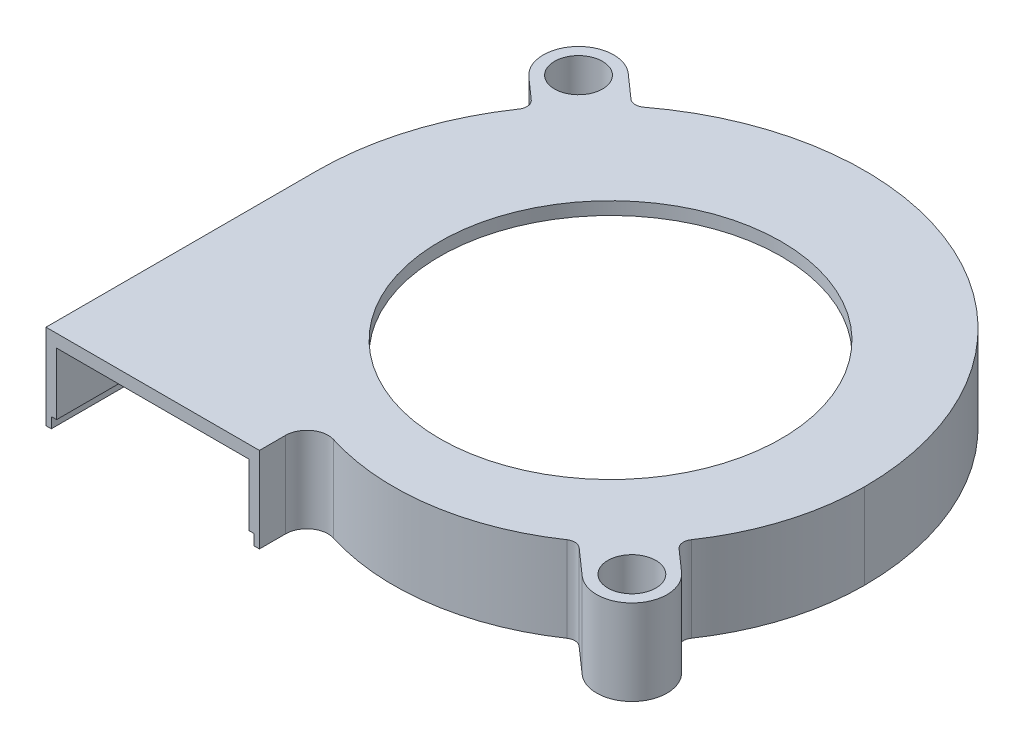
ISO-10303-21;
HEADER;
FILE_DESCRIPTION(('STEP AP214'),'2;1');
FILE_NAME('part.step','',(''),(''),'','','');
FILE_SCHEMA(('AUTOMOTIVE_DESIGN { 1 0 10303 214 1 1 1 1 }'));
ENDSEC;
DATA;
#1=APPLICATION_CONTEXT('core data for automotive mechanical design processes');
#2=APPLICATION_PROTOCOL_DEFINITION('international standard','automotive_design',2000,#1);
#3=PRODUCT_CONTEXT('',#1,'mechanical');
#4=PRODUCT('Part','Part','',(#3));
#5=PRODUCT_RELATED_PRODUCT_CATEGORY('part','',(#4));
#6=PRODUCT_DEFINITION_FORMATION('','',#4);
#7=PRODUCT_DEFINITION_CONTEXT('part definition',#1,'design');
#8=PRODUCT_DEFINITION('design','',#6,#7);
#9=PRODUCT_DEFINITION_SHAPE('','',#8);
#10=(LENGTH_UNIT() NAMED_UNIT(*) SI_UNIT(.MILLI.,.METRE.));
#11=(NAMED_UNIT(*) PLANE_ANGLE_UNIT() SI_UNIT($,.RADIAN.));
#12=(NAMED_UNIT(*) SI_UNIT($,.STERADIAN.) SOLID_ANGLE_UNIT());
#13=UNCERTAINTY_MEASURE_WITH_UNIT(LENGTH_MEASURE(1.E-05),#10,'distance_accuracy_value','');
#14=(GEOMETRIC_REPRESENTATION_CONTEXT(3) GLOBAL_UNCERTAINTY_ASSIGNED_CONTEXT((#13)) GLOBAL_UNIT_ASSIGNED_CONTEXT((#10,
#11,#12)) REPRESENTATION_CONTEXT('',''));
#15=CARTESIAN_POINT('',(0.,0.,0.));
#16=DIRECTION('',(0.,0.,1.));
#17=DIRECTION('',(1.,0.,0.));
#18=AXIS2_PLACEMENT_3D('',#15,#16,#17);
#19=CARTESIAN_POINT('',(-8.5,70.26503959981,25.4));
#20=DIRECTION('',(1.,0.,0.));
#21=DIRECTION('',(0.,0.,-1.));
#22=AXIS2_PLACEMENT_3D('',#19,#20,#21);
#23=PLANE('',#22);
#24=DIRECTION('',(0.,0.,-1.));
#25=VECTOR('',#24,1.);
#26=CARTESIAN_POINT('',(-8.5,-7.,22.9558491109208));
#27=LINE('',#26,#25);
#28=CARTESIAN_POINT('',(-8.5,-7.,25.4));
#29=VERTEX_POINT('',#28);
#30=CARTESIAN_POINT('',(-8.5,-7.,22.9558491109208));
#31=VERTEX_POINT('',#30);
#32=EDGE_CURVE('E647',#29,#31,#27,.T.);
#33=ORIENTED_EDGE('',*,*,#32,.F.);
#34=DIRECTION('',(0.,-1.,0.));
#35=VECTOR('',#34,1.);
#36=CARTESIAN_POINT('',(-8.5,70.26503959981,25.4));
#37=LINE('',#36,#35);
#38=CARTESIAN_POINT('',(-8.5,-1.20000000000001,25.4));
#39=VERTEX_POINT('',#38);
#40=EDGE_CURVE('E578',#39,#29,#37,.T.);
#41=ORIENTED_EDGE('',*,*,#40,.F.);
#42=DIRECTION('',(0.,0.,-1.));
#43=VECTOR('',#42,1.);
#44=CARTESIAN_POINT('',(-8.5,-1.20000000000001,25.4));
#45=LINE('',#44,#43);
#46=CARTESIAN_POINT('',(-8.49999999999999,-1.20000000000001,22.9558491109208));
#47=VERTEX_POINT('',#46);
#48=EDGE_CURVE('E581',#39,#47,#45,.T.);
#49=ORIENTED_EDGE('',*,*,#48,.T.);
#50=DIRECTION('',(0.,-1.,0.));
#51=VECTOR('',#50,1.);
#52=CARTESIAN_POINT('',(-8.5,70.26503959981,22.9558491109208));
#53=LINE('',#52,#51);
#54=EDGE_CURVE('E575',#47,#31,#53,.T.);
#55=ORIENTED_EDGE('',*,*,#54,.T.);
#56=EDGE_LOOP('',(#33,#41,#49,#55));
#57=FACE_BOUND('',#56,.T.);
#58=ADVANCED_FACE('F42',(#57),#23,.F.);
#59=CARTESIAN_POINT('',(-5.5,70.26503959981,22.9558491109208));
#60=DIRECTION('',(0.,-1.,0.));
#61=DIRECTION('',(0.,0.,-1.));
#62=AXIS2_PLACEMENT_3D('',#59,#60,#61);
#63=CYLINDRICAL_SURFACE('',#62,3.);
#64=CARTESIAN_POINT('',(-5.5,-7.,22.9558491109208));
#65=DIRECTION('',(0.,-1.,0.));
#66=DIRECTION('',(0.,0.,-1.));
#67=AXIS2_PLACEMENT_3D('',#64,#65,#66);
#68=CIRCLE('',#67,3.);
#69=CARTESIAN_POINT('',(-4.5985649942554,-7.,20.0944831905794));
#70=VERTEX_POINT('',#69);
#71=EDGE_CURVE('E591',#31,#70,#68,.T.);
#72=ORIENTED_EDGE('',*,*,#71,.F.);
#73=ORIENTED_EDGE('',*,*,#54,.F.);
#74=CARTESIAN_POINT('',(-5.5,-1.20000000000001,22.9558491109208));
#75=DIRECTION('',(0.,-1.,0.));
#76=DIRECTION('',(0.,0.,-1.));
#77=AXIS2_PLACEMENT_3D('',#74,#75,#76);
#78=CIRCLE('',#77,3.);
#79=CARTESIAN_POINT('',(-4.59856499423902,-1.20000000000001,20.0944831905274));
#80=VERTEX_POINT('',#79);
#81=EDGE_CURVE('E585',#47,#80,#78,.T.);
#82=ORIENTED_EDGE('',*,*,#81,.T.);
#83=DIRECTION('',(0.,-1.,0.));
#84=VECTOR('',#83,1.);
#85=CARTESIAN_POINT('',(-4.59856499423902,70.26503959981,20.0944831905274));
#86=LINE('',#85,#84);
#87=EDGE_CURVE('E579',#80,#70,#86,.T.);
#88=ORIENTED_EDGE('',*,*,#87,.T.);
#89=EDGE_LOOP('',(#72,#73,#82,#88));
#90=FACE_BOUND('',#89,.T.);
#91=ADVANCED_FACE('F391',(#90),#63,.T.);
#92=CARTESIAN_POINT('',(1.73193277310925,70.26503959981,0.));
#93=DIRECTION('',(0.,-1.,0.));
#94=DIRECTION('',(0.,0.,-1.));
#95=AXIS2_PLACEMENT_3D('',#92,#93,#94);
#96=CYLINDRICAL_SURFACE('',#95,21.0680672268908);
#97=CARTESIAN_POINT('',(1.73193277310925,-7.,0.));
#98=DIRECTION('',(0.,1.,0.));
#99=DIRECTION('',(0.,0.,-1.));
#100=AXIS2_PLACEMENT_3D('',#97,#98,#99);
#101=CIRCLE('',#100,21.0680672269453);
#102=CARTESIAN_POINT('',(22.800000024916,-7.,-0.000327043078988983));
#103=VERTEX_POINT('',#102);
#104=EDGE_CURVE('E594',#70,#103,#101,.T.);
#105=ORIENTED_EDGE('',*,*,#104,.F.);
#106=ORIENTED_EDGE('',*,*,#87,.F.);
#107=CARTESIAN_POINT('',(1.73193277310925,-1.20000000000001,0.));
#108=DIRECTION('',(0.,-1.,0.));
#109=DIRECTION('',(0.,0.,-1.));
#110=AXIS2_PLACEMENT_3D('',#107,#108,#109);
#111=CIRCLE('',#110,21.0680672268908);
#112=CARTESIAN_POINT('',(22.7999999974641,-1.20000000000001,-0.000326883642031274));
#113=VERTEX_POINT('',#112);
#114=EDGE_CURVE('E609',#80,#113,#111,.F.);
#115=ORIENTED_EDGE('',*,*,#114,.T.);
#116=DIRECTION('',(0.,-1.,0.));
#117=VECTOR('',#116,1.);
#118=CARTESIAN_POINT('',(22.7999999974641,70.26503959981,-0.000326883642031271));
#119=LINE('',#118,#117);
#120=EDGE_CURVE('E613',#113,#103,#119,.T.);
#121=ORIENTED_EDGE('',*,*,#120,.T.);
#122=EDGE_LOOP('',(#105,#106,#115,#121));
#123=FACE_BOUND('',#122,.T.);
#124=ADVANCED_FACE('F397',(#123),#96,.F.);
#125=CARTESIAN_POINT('',(-1.85,70.26503959981,-0.016796874999999));
#126=DIRECTION('',(0.,-1.,0.));
#127=DIRECTION('',(0.,0.,-1.));
#128=AXIS2_PLACEMENT_3D('',#125,#126,#127);
#129=CYLINDRICAL_SURFACE('',#128,24.6500054997072);
#130=CARTESIAN_POINT('',(-1.85,-7.,-0.016796874999999));
#131=DIRECTION('',(0.,1.,0.));
#132=DIRECTION('',(0.,0.,-1.));
#133=AXIS2_PLACEMENT_3D('',#130,#131,#132);
#134=CIRCLE('',#133,24.6500055270525);
#135=CARTESIAN_POINT('',(-26.5000000525161,-7.00000000000001,-0.000327424430267257));
#136=VERTEX_POINT('',#135);
#137=EDGE_CURVE('E63',#103,#136,#134,.T.);
#138=ORIENTED_EDGE('',*,*,#137,.F.);
#139=ORIENTED_EDGE('',*,*,#120,.F.);
#140=CARTESIAN_POINT('',(-1.85,-1.20000000000001,-0.016796874999999));
#141=DIRECTION('',(0.,-1.,0.));
#142=DIRECTION('',(0.,0.,-1.));
#143=AXIS2_PLACEMENT_3D('',#140,#141,#142);
#144=CIRCLE('',#143,24.6500054997072);
#145=CARTESIAN_POINT('',(-26.5000000525161,-1.20000000000001,-0.000327424430267257));
#146=VERTEX_POINT('',#145);
#147=EDGE_CURVE('E597',#113,#146,#144,.F.);
#148=ORIENTED_EDGE('',*,*,#147,.T.);
#149=DIRECTION('',(0.,-1.,0.));
#150=VECTOR('',#149,1.);
#151=CARTESIAN_POINT('',(-26.5000000525161,70.26503959981,-0.000327424430267257));
#152=LINE('',#151,#150);
#153=EDGE_CURVE('E627',#146,#136,#152,.T.);
#154=ORIENTED_EDGE('',*,*,#153,.T.);
#155=EDGE_LOOP('',(#138,#139,#148,#154));
#156=FACE_BOUND('',#155,.T.);
#157=ADVANCED_FACE('F407',(#156),#129,.F.);
#158=CARTESIAN_POINT('',(-26.5000001072067,70.26503959981,-0.000327424393735107));
#159=DIRECTION('',(-1.,0.,4.22068338812948E-09));
#160=DIRECTION('',(4.22068338812948E-09,0.,1.));
#161=AXIS2_PLACEMENT_3D('',#158,#159,#160);
#162=PLANE('',#161);
#163=DIRECTION('',(-4.28055939719574E-11,0.,1.));
#164=VECTOR('',#163,1.);
#165=CARTESIAN_POINT('',(-26.5000000536034,-7.,25.4));
#166=LINE('',#165,#164);
#167=CARTESIAN_POINT('',(-26.5000000536034,-7.,25.4));
#168=VERTEX_POINT('',#167);
#169=EDGE_CURVE('E683',#136,#168,#166,.T.);
#170=ORIENTED_EDGE('',*,*,#169,.F.);
#171=ORIENTED_EDGE('',*,*,#153,.F.);
#172=DIRECTION('',(4.22068338812948E-09,0.,1.));
#173=VECTOR('',#172,1.);
#174=CARTESIAN_POINT('',(-26.5000001072067,-1.20000000000001,-0.000327424393735107));
#175=LINE('',#174,#173);
#176=CARTESIAN_POINT('',(-26.5,-1.20000000000001,25.4));
#177=VERTEX_POINT('',#176);
#178=EDGE_CURVE('E620',#146,#177,#175,.T.);
#179=ORIENTED_EDGE('',*,*,#178,.T.);
#180=DIRECTION('',(0.,-1.,0.));
#181=VECTOR('',#180,1.);
#182=CARTESIAN_POINT('',(-26.5,70.26503959981,25.4));
#183=LINE('',#182,#181);
#184=EDGE_CURVE('E567',#177,#168,#183,.T.);
#185=ORIENTED_EDGE('',*,*,#184,.T.);
#186=EDGE_LOOP('',(#170,#171,#179,#185));
#187=FACE_BOUND('',#186,.T.);
#188=ADVANCED_FACE('F411',(#187),#162,.F.);
#189=CARTESIAN_POINT('',(0.,-8.,0.));
#190=DIRECTION('',(0.,1.,0.));
#191=DIRECTION('',(0.,0.,1.));
#192=AXIS2_PLACEMENT_3D('',#189,#190,#191);
#193=CYLINDRICAL_SURFACE('',#192,16.);
#194=CARTESIAN_POINT('',(0.,0.,0.));
#195=DIRECTION('',(0.,1.,0.));
#196=DIRECTION('',(0.,0.,1.));
#197=AXIS2_PLACEMENT_3D('',#194,#195,#196);
#198=CIRCLE('',#197,16.);
#199=CARTESIAN_POINT('',(0.,0.,16.));
#200=VERTEX_POINT('',#199);
#201=EDGE_CURVE('E435',#200,#200,#198,.T.);
#202=ORIENTED_EDGE('',*,*,#201,.T.);
#203=EDGE_LOOP('',(#202));
#204=FACE_BOUND('',#203,.T.);
#205=CARTESIAN_POINT('',(0.,-1.2,0.));
#206=DIRECTION('',(0.,-1.,0.));
#207=DIRECTION('',(0.,0.,-1.));
#208=AXIS2_PLACEMENT_3D('',#205,#206,#207);
#209=CIRCLE('',#208,16.);
#210=CARTESIAN_POINT('',(0.,-1.2,-16.));
#211=VERTEX_POINT('',#210);
#212=EDGE_CURVE('E46',#211,#211,#209,.F.);
#213=ORIENTED_EDGE('',*,*,#212,.F.);
#214=EDGE_LOOP('',(#213));
#215=FACE_BOUND('',#214,.T.);
#216=ADVANCED_FACE('F388',(#204,#215),#193,.F.);
#217=CARTESIAN_POINT('',(-23.,-8.,-20.));
#218=DIRECTION('',(0.,1.,0.));
#219=DIRECTION('',(0.,0.,1.));
#220=AXIS2_PLACEMENT_3D('',#217,#218,#219);
#221=CYLINDRICAL_SURFACE('',#220,3.3);
#222=CARTESIAN_POINT('',(-23.,0.,-20.));
#223=DIRECTION('',(0.,1.,0.));
#224=DIRECTION('',(0.,0.,-1.));
#225=AXIS2_PLACEMENT_3D('',#222,#223,#224);
#226=CIRCLE('',#225,3.3);
#227=CARTESIAN_POINT('',(-20.8147472716434,0.,-22.4727859820878));
#228=VERTEX_POINT('',#227);
#229=CARTESIAN_POINT('',(-25.1852527283566,0.,-17.5272140179122));
#230=VERTEX_POINT('',#229);
#231=EDGE_CURVE('E261',#228,#230,#226,.T.);
#232=ORIENTED_EDGE('',*,*,#231,.F.);
#233=DIRECTION('',(0.,1.,0.));
#234=VECTOR('',#233,1.);
#235=CARTESIAN_POINT('',(-20.8147472716434,-8.,-22.4727859820878));
#236=LINE('',#235,#234);
#237=CARTESIAN_POINT('',(-20.8147472716434,-8.,-22.4727859820878));
#238=VERTEX_POINT('',#237);
#239=EDGE_CURVE('E12',#238,#228,#236,.T.);
#240=ORIENTED_EDGE('',*,*,#239,.F.);
#241=CARTESIAN_POINT('',(-23.,-8.,-20.));
#242=DIRECTION('',(0.,1.,0.));
#243=DIRECTION('',(0.,0.,-1.));
#244=AXIS2_PLACEMENT_3D('',#241,#242,#243);
#245=CIRCLE('',#244,3.3);
#246=CARTESIAN_POINT('',(-25.1852527283566,-8.,-17.5272140179122));
#247=VERTEX_POINT('',#246);
#248=EDGE_CURVE('E330',#238,#247,#245,.T.);
#249=ORIENTED_EDGE('',*,*,#248,.T.);
#250=DIRECTION('',(0.,1.,0.));
#251=VECTOR('',#250,1.);
#252=CARTESIAN_POINT('',(-25.1852527283566,-8.,-17.5272140179122));
#253=LINE('',#252,#251);
#254=EDGE_CURVE('E161',#247,#230,#253,.T.);
#255=ORIENTED_EDGE('',*,*,#254,.T.);
#256=EDGE_LOOP('',(#232,#240,#249,#255));
#257=FACE_BOUND('',#256,.T.);
#258=ADVANCED_FACE('F44',(#257),#221,.T.);
#259=CARTESIAN_POINT('',(-20.8147472716434,-8.,-22.4727859820878));
#260=DIRECTION('',(0.66219779647171,0.,-0.749329085481147));
#261=DIRECTION('',(-0.749329085481147,0.,-0.66219779647171));
#262=AXIS2_PLACEMENT_3D('',#259,#260,#261);
#263=PLANE('',#262);
#264=DIRECTION('',(-0.749329085481147,0.,-0.66219779647171));
#265=VECTOR('',#264,1.);
#266=CARTESIAN_POINT('',(-20.8147472716434,0.,-22.4727859820878));
#267=LINE('',#266,#265);
#268=CARTESIAN_POINT('',(-18.5989053771657,0.,-20.5146001218517));
#269=VERTEX_POINT('',#268);
#270=EDGE_CURVE('E327',#269,#228,#267,.T.);
#271=ORIENTED_EDGE('',*,*,#270,.F.);
#272=DIRECTION('',(0.,1.,0.));
#273=VECTOR('',#272,1.);
#274=CARTESIAN_POINT('',(-18.5989053771657,-8.,-20.5146001218517));
#275=LINE('',#274,#273);
#276=CARTESIAN_POINT('',(-18.5989053771657,-8.,-20.5146001218517));
#277=VERTEX_POINT('',#276);
#278=EDGE_CURVE('E52',#277,#269,#275,.T.);
#279=ORIENTED_EDGE('',*,*,#278,.F.);
#280=DIRECTION('',(-0.749329085481147,0.,-0.66219779647171));
#281=VECTOR('',#280,1.);
#282=CARTESIAN_POINT('',(-20.8147472716434,-8.,-22.4727859820878));
#283=LINE('',#282,#281);
#284=EDGE_CURVE('E247',#277,#238,#283,.T.);
#285=ORIENTED_EDGE('',*,*,#284,.T.);
#286=ORIENTED_EDGE('',*,*,#239,.T.);
#287=EDGE_LOOP('',(#271,#279,#285,#286));
#288=FACE_BOUND('',#287,.T.);
#289=ADVANCED_FACE('F380',(#288),#263,.T.);
#290=CARTESIAN_POINT('',(-17.936707580694,-8.,-21.2639292073329));
#291=DIRECTION('',(0.,1.,0.));
#292=DIRECTION('',(0.,0.,1.));
#293=AXIS2_PLACEMENT_3D('',#290,#291,#292);
#294=CYLINDRICAL_SURFACE('',#293,1.);
#295=CARTESIAN_POINT('',(-17.936707580694,0.,-21.2639292073329));
#296=DIRECTION('',(0.,-1.,0.));
#297=DIRECTION('',(0.,0.,1.));
#298=AXIS2_PLACEMENT_3D('',#295,#296,#297);
#299=CIRCLE('',#298,1.);
#300=CARTESIAN_POINT('',(-17.3330789029862,0.,-20.4666636183045));
#301=VERTEX_POINT('',#300);
#302=EDGE_CURVE('E231',#301,#269,#299,.T.);
#303=ORIENTED_EDGE('',*,*,#302,.F.);
#304=DIRECTION('',(0.,1.,0.));
#305=VECTOR('',#304,1.);
#306=CARTESIAN_POINT('',(-17.3330789029862,-8.,-20.4666636183045));
#307=LINE('',#306,#305);
#308=CARTESIAN_POINT('',(-17.3330789029862,-8.,-20.4666636183045));
#309=VERTEX_POINT('',#308);
#310=EDGE_CURVE('E225',#309,#301,#307,.T.);
#311=ORIENTED_EDGE('',*,*,#310,.F.);
#312=CARTESIAN_POINT('',(-17.936707580694,-8.,-21.2639292073329));
#313=DIRECTION('',(0.,-1.,0.));
#314=DIRECTION('',(0.,0.,1.));
#315=AXIS2_PLACEMENT_3D('',#312,#313,#314);
#316=CIRCLE('',#315,1.);
#317=EDGE_CURVE('E228',#309,#277,#316,.T.);
#318=ORIENTED_EDGE('',*,*,#317,.T.);
#319=ORIENTED_EDGE('',*,*,#278,.T.);
#320=EDGE_LOOP('',(#303,#311,#318,#319));
#321=FACE_BOUND('',#320,.T.);
#322=ADVANCED_FACE('F227',(#321),#294,.F.);
#323=CARTESIAN_POINT('',(-1.85,-8.,-0.016796874999999));
#324=DIRECTION('',(0.,1.,0.));
#325=DIRECTION('',(0.,0.,1.));
#326=AXIS2_PLACEMENT_3D('',#323,#324,#325);
#327=CYLINDRICAL_SURFACE('',#326,25.6500054997072);
#328=CARTESIAN_POINT('',(-1.85,0.,-0.016796874999999));
#329=DIRECTION('',(0.,1.,0.));
#330=DIRECTION('',(0.,0.,1.));
#331=AXIS2_PLACEMENT_3D('',#328,#329,#330);
#332=CIRCLE('',#331,25.6500054997072);
#333=CARTESIAN_POINT('',(23.8,0.,0.));
#334=VERTEX_POINT('',#333);
#335=EDGE_CURVE('E322',#334,#301,#332,.T.);
#336=ORIENTED_EDGE('',*,*,#335,.F.);
#337=DIRECTION('',(0.,1.,0.));
#338=VECTOR('',#337,1.);
#339=CARTESIAN_POINT('',(23.8,-8.,0.));
#340=LINE('',#339,#338);
#341=CARTESIAN_POINT('',(23.8,-8.,0.));
#342=VERTEX_POINT('',#341);
#343=EDGE_CURVE('E237',#342,#334,#340,.T.);
#344=ORIENTED_EDGE('',*,*,#343,.F.);
#345=CARTESIAN_POINT('',(-1.85,-8.,-0.016796874999999));
#346=DIRECTION('',(0.,1.,0.));
#347=DIRECTION('',(0.,0.,1.));
#348=AXIS2_PLACEMENT_3D('',#345,#346,#347);
#349=CIRCLE('',#348,25.6500054997072);
#350=EDGE_CURVE('E245',#342,#309,#349,.T.);
#351=ORIENTED_EDGE('',*,*,#350,.T.);
#352=ORIENTED_EDGE('',*,*,#310,.T.);
#353=EDGE_LOOP('',(#336,#344,#351,#352));
#354=FACE_BOUND('',#353,.T.);
#355=ADVANCED_FACE('F250',(#354),#327,.T.);
#356=CARTESIAN_POINT('',(1.73193277310925,-8.,0.));
#357=DIRECTION('',(0.,1.,0.));
#358=DIRECTION('',(0.,0.,1.));
#359=AXIS2_PLACEMENT_3D('',#356,#357,#358);
#360=CYLINDRICAL_SURFACE('',#359,22.0680672268908);
#361=CARTESIAN_POINT('',(1.73193277310925,0.,0.));
#362=DIRECTION('',(0.,1.,0.));
#363=DIRECTION('',(0.,0.,-1.));
#364=AXIS2_PLACEMENT_3D('',#361,#362,#363);
#365=CIRCLE('',#364,22.0680672268908);
#366=CARTESIAN_POINT('',(19.9790752063348,0.,12.4113409489929));
#367=VERTEX_POINT('',#366);
#368=EDGE_CURVE('E318',#367,#334,#365,.T.);
#369=ORIENTED_EDGE('',*,*,#368,.F.);
#370=DIRECTION('',(0.,1.,0.));
#371=VECTOR('',#370,1.);
#372=CARTESIAN_POINT('',(19.9790752063348,-8.,12.4113409489929));
#373=LINE('',#372,#371);
#374=CARTESIAN_POINT('',(19.9790752063348,-8.,12.4113409489929));
#375=VERTEX_POINT('',#374);
#376=EDGE_CURVE('E336',#375,#367,#373,.T.);
#377=ORIENTED_EDGE('',*,*,#376,.F.);
#378=CARTESIAN_POINT('',(1.73193277310925,-8.,0.));
#379=DIRECTION('',(0.,1.,0.));
#380=DIRECTION('',(0.,0.,-1.));
#381=AXIS2_PLACEMENT_3D('',#378,#379,#380);
#382=CIRCLE('',#381,22.0680672268908);
#383=EDGE_CURVE('E252',#375,#342,#382,.T.);
#384=ORIENTED_EDGE('',*,*,#383,.T.);
#385=ORIENTED_EDGE('',*,*,#343,.T.);
#386=EDGE_LOOP('',(#369,#377,#384,#385));
#387=FACE_BOUND('',#386,.T.);
#388=ADVANCED_FACE('F1015',(#387),#360,.T.);
#389=CARTESIAN_POINT('',(20.8059325040591,-8.,12.9737527280304));
#390=DIRECTION('',(0.,1.,0.));
#391=DIRECTION('',(0.,0.,1.));
#392=AXIS2_PLACEMENT_3D('',#389,#390,#391);
#393=CYLINDRICAL_SURFACE('',#392,1.);
#394=CARTESIAN_POINT('',(20.8059325040591,0.,12.9737527280304));
#395=DIRECTION('',(0.,-1.,0.));
#396=DIRECTION('',(0.,0.,-1.));
#397=AXIS2_PLACEMENT_3D('',#394,#395,#396);
#398=CIRCLE('',#397,1.);
#399=CARTESIAN_POINT('',(20.1437347075874,0.,13.7230818135115));
#400=VERTEX_POINT('',#399);
#401=EDGE_CURVE('E314',#400,#367,#398,.T.);
#402=ORIENTED_EDGE('',*,*,#401,.F.);
#403=DIRECTION('',(0.,1.,0.));
#404=VECTOR('',#403,1.);
#405=CARTESIAN_POINT('',(20.1437347075874,-8.,13.7230818135115));
#406=LINE('',#405,#404);
#407=CARTESIAN_POINT('',(20.1437347075874,-8.,13.7230818135115));
#408=VERTEX_POINT('',#407);
#409=EDGE_CURVE('E339',#408,#400,#406,.T.);
#410=ORIENTED_EDGE('',*,*,#409,.F.);
#411=CARTESIAN_POINT('',(20.8059325040591,-8.,12.9737527280304));
#412=DIRECTION('',(0.,-1.,0.));
#413=DIRECTION('',(0.,0.,-1.));
#414=AXIS2_PLACEMENT_3D('',#411,#412,#413);
#415=CIRCLE('',#414,1.);
#416=EDGE_CURVE('E255',#408,#375,#415,.T.);
#417=ORIENTED_EDGE('',*,*,#416,.T.);
#418=ORIENTED_EDGE('',*,*,#376,.T.);
#419=EDGE_LOOP('',(#402,#410,#417,#418));
#420=FACE_BOUND('',#419,.T.);
#421=ADVANCED_FACE('F510',(#420),#393,.F.);
#422=CARTESIAN_POINT('',(22.1852527283566,-8.,15.5272140179122));
#423=DIRECTION('',(0.66219779647171,0.,-0.749329085481147));
#424=DIRECTION('',(-0.749329085481147,0.,-0.66219779647171));
#425=AXIS2_PLACEMENT_3D('',#422,#423,#424);
#426=PLANE('',#425);
#427=DIRECTION('',(-0.749329085481146,0.,-0.66219779647171));
#428=VECTOR('',#427,1.);
#429=CARTESIAN_POINT('',(22.1852527283566,0.,15.5272140179122));
#430=LINE('',#429,#428);
#431=CARTESIAN_POINT('',(22.1852527283566,0.,15.5272140179122));
#432=VERTEX_POINT('',#431);
#433=EDGE_CURVE('E310',#432,#400,#430,.T.);
#434=ORIENTED_EDGE('',*,*,#433,.F.);
#435=DIRECTION('',(0.,1.,0.));
#436=VECTOR('',#435,1.);
#437=CARTESIAN_POINT('',(22.1852527283566,-8.,15.5272140179122));
#438=LINE('',#437,#436);
#439=CARTESIAN_POINT('',(22.1852527283566,-8.,15.5272140179122));
#440=VERTEX_POINT('',#439);
#441=EDGE_CURVE('E342',#440,#432,#438,.T.);
#442=ORIENTED_EDGE('',*,*,#441,.F.);
#443=DIRECTION('',(-0.749329085481146,0.,-0.66219779647171));
#444=VECTOR('',#443,1.);
#445=CARTESIAN_POINT('',(22.1852527283566,-8.,15.5272140179122));
#446=LINE('',#445,#444);
#447=EDGE_CURVE('E502',#440,#408,#446,.T.);
#448=ORIENTED_EDGE('',*,*,#447,.T.);
#449=ORIENTED_EDGE('',*,*,#409,.T.);
#450=EDGE_LOOP('',(#434,#442,#448,#449));
#451=FACE_BOUND('',#450,.T.);
#452=ADVANCED_FACE('F516',(#451),#426,.T.);
#453=CARTESIAN_POINT('',(20.,-8.,18.));
#454=DIRECTION('',(0.,1.,0.));
#455=DIRECTION('',(0.,0.,1.));
#456=AXIS2_PLACEMENT_3D('',#453,#454,#455);
#457=CYLINDRICAL_SURFACE('',#456,3.3);
#458=CARTESIAN_POINT('',(20.,0.,18.));
#459=DIRECTION('',(0.,1.,0.));
#460=DIRECTION('',(0.,0.,-1.));
#461=AXIS2_PLACEMENT_3D('',#458,#459,#460);
#462=CIRCLE('',#461,3.3);
#463=CARTESIAN_POINT('',(17.8147472716434,0.,20.4727859820878));
#464=VERTEX_POINT('',#463);
#465=EDGE_CURVE('E306',#464,#432,#462,.T.);
#466=ORIENTED_EDGE('',*,*,#465,.F.);
#467=DIRECTION('',(0.,1.,0.));
#468=VECTOR('',#467,1.);
#469=CARTESIAN_POINT('',(17.8147472716434,-8.,20.4727859820878));
#470=LINE('',#469,#468);
#471=CARTESIAN_POINT('',(17.8147472716434,-8.,20.4727859820878));
#472=VERTEX_POINT('',#471);
#473=EDGE_CURVE('E345',#472,#464,#470,.T.);
#474=ORIENTED_EDGE('',*,*,#473,.F.);
#475=CARTESIAN_POINT('',(20.,-8.,18.));
#476=DIRECTION('',(0.,1.,0.));
#477=DIRECTION('',(0.,0.,-1.));
#478=AXIS2_PLACEMENT_3D('',#475,#476,#477);
#479=CIRCLE('',#478,3.3);
#480=EDGE_CURVE('E498',#472,#440,#479,.T.);
#481=ORIENTED_EDGE('',*,*,#480,.T.);
#482=ORIENTED_EDGE('',*,*,#441,.T.);
#483=EDGE_LOOP('',(#466,#474,#481,#482));
#484=FACE_BOUND('',#483,.T.);
#485=ADVANCED_FACE('F519',(#484),#457,.T.);
#486=CARTESIAN_POINT('',(17.8147472716434,-8.,20.4727859820878));
#487=DIRECTION('',(-0.66219779647171,0.,0.749329085481147));
#488=DIRECTION('',(0.749329085481147,0.,0.66219779647171));
#489=AXIS2_PLACEMENT_3D('',#486,#487,#488);
#490=PLANE('',#489);
#491=DIRECTION('',(0.749329085481147,0.,0.66219779647171));
#492=VECTOR('',#491,1.);
#493=CARTESIAN_POINT('',(17.8147472716434,0.,20.4727859820878));
#494=LINE('',#493,#492);
#495=CARTESIAN_POINT('',(15.3769800356374,0.,18.3184800525942));
#496=VERTEX_POINT('',#495);
#497=EDGE_CURVE('E302',#496,#464,#494,.T.);
#498=ORIENTED_EDGE('',*,*,#497,.F.);
#499=DIRECTION('',(0.,1.,0.));
#500=VECTOR('',#499,1.);
#501=CARTESIAN_POINT('',(15.3769800356374,-8.,18.3184800525942));
#502=LINE('',#501,#500);
#503=CARTESIAN_POINT('',(15.3769800356374,-8.,18.3184800525942));
#504=VERTEX_POINT('',#503);
#505=EDGE_CURVE('E348',#504,#496,#502,.T.);
#506=ORIENTED_EDGE('',*,*,#505,.F.);
#507=DIRECTION('',(0.749329085481147,0.,0.66219779647171));
#508=VECTOR('',#507,1.);
#509=CARTESIAN_POINT('',(17.8147472716434,-8.,20.4727859820878));
#510=LINE('',#509,#508);
#511=EDGE_CURVE('E494',#504,#472,#510,.T.);
#512=ORIENTED_EDGE('',*,*,#511,.T.);
#513=ORIENTED_EDGE('',*,*,#473,.T.);
#514=EDGE_LOOP('',(#498,#506,#512,#513));
#515=FACE_BOUND('',#514,.T.);
#516=ADVANCED_FACE('F524',(#515),#490,.T.);
#517=CARTESIAN_POINT('',(14.7147822391657,-8.,19.0678091380753));
#518=DIRECTION('',(0.,1.,0.));
#519=DIRECTION('',(0.,0.,1.));
#520=AXIS2_PLACEMENT_3D('',#517,#518,#519);
#521=CYLINDRICAL_SURFACE('',#520,0.999999999999999);
#522=CARTESIAN_POINT('',(14.7147822391657,0.,19.0678091380753));
#523=DIRECTION('',(0.,-1.,0.));
#524=DIRECTION('',(0.,0.,1.));
#525=AXIS2_PLACEMENT_3D('',#522,#523,#524);
#526=CIRCLE('',#525,0.999999999999999);
#527=CARTESIAN_POINT('',(14.1519761168165,0.,18.2412202023604));
#528=VERTEX_POINT('',#527);
#529=EDGE_CURVE('E298',#528,#496,#526,.T.);
#530=ORIENTED_EDGE('',*,*,#529,.F.);
#531=DIRECTION('',(0.,1.,0.));
#532=VECTOR('',#531,1.);
#533=CARTESIAN_POINT('',(14.1519761168165,-8.,18.2412202023604));
#534=LINE('',#533,#532);
#535=CARTESIAN_POINT('',(14.1519761168165,-8.,18.2412202023604));
#536=VERTEX_POINT('',#535);
#537=EDGE_CURVE('E351',#536,#528,#534,.T.);
#538=ORIENTED_EDGE('',*,*,#537,.F.);
#539=CARTESIAN_POINT('',(14.7147822391657,-8.,19.0678091380753));
#540=DIRECTION('',(0.,-1.,0.));
#541=DIRECTION('',(0.,0.,1.));
#542=AXIS2_PLACEMENT_3D('',#539,#540,#541);
#543=CIRCLE('',#542,0.999999999999999);
#544=EDGE_CURVE('E490',#536,#504,#543,.T.);
#545=ORIENTED_EDGE('',*,*,#544,.T.);
#546=ORIENTED_EDGE('',*,*,#505,.T.);
#547=EDGE_LOOP('',(#530,#538,#545,#546));
#548=FACE_BOUND('',#547,.T.);
#549=ADVANCED_FACE('F527',(#548),#521,.F.);
#550=CARTESIAN_POINT('',(1.73193277310925,-8.,0.));
#551=DIRECTION('',(0.,1.,0.));
#552=DIRECTION('',(0.,0.,1.));
#553=AXIS2_PLACEMENT_3D('',#550,#551,#552);
#554=CYLINDRICAL_SURFACE('',#553,22.0680672268908);
#555=CARTESIAN_POINT('',(1.73193277310925,0.,0.));
#556=DIRECTION('',(0.,1.,0.));
#557=DIRECTION('',(0.,0.,-1.));
#558=AXIS2_PLACEMENT_3D('',#555,#556,#557);
#559=CIRCLE('',#558,22.0680672268908);
#560=CARTESIAN_POINT('',(-4.89904332949268,0.,21.0482718306585));
#561=VERTEX_POINT('',#560);
#562=EDGE_CURVE('E294',#561,#528,#559,.T.);
#563=ORIENTED_EDGE('',*,*,#562,.F.);
#564=DIRECTION('',(0.,1.,0.));
#565=VECTOR('',#564,1.);
#566=CARTESIAN_POINT('',(-4.89904332949268,-8.,21.0482718306585));
#567=LINE('',#566,#565);
#568=CARTESIAN_POINT('',(-4.89904332949268,-8.,21.0482718306585));
#569=VERTEX_POINT('',#568);
#570=EDGE_CURVE('E354',#569,#561,#567,.T.);
#571=ORIENTED_EDGE('',*,*,#570,.F.);
#572=CARTESIAN_POINT('',(1.73193277310925,-8.,0.));
#573=DIRECTION('',(0.,1.,0.));
#574=DIRECTION('',(0.,0.,-1.));
#575=AXIS2_PLACEMENT_3D('',#572,#573,#574);
#576=CIRCLE('',#575,22.0680672268908);
#577=EDGE_CURVE('E486',#569,#536,#576,.T.);
#578=ORIENTED_EDGE('',*,*,#577,.T.);
#579=ORIENTED_EDGE('',*,*,#537,.T.);
#580=EDGE_LOOP('',(#563,#571,#578,#579));
#581=FACE_BOUND('',#580,.T.);
#582=ADVANCED_FACE('F532',(#581),#554,.T.);
#583=CARTESIAN_POINT('',(-5.5,-8.,22.9558491109208));
#584=DIRECTION('',(0.,1.,0.));
#585=DIRECTION('',(0.,0.,1.));
#586=AXIS2_PLACEMENT_3D('',#583,#584,#585);
#587=CYLINDRICAL_SURFACE('',#586,2.);
#588=CARTESIAN_POINT('',(-5.5,0.,22.9558491109208));
#589=DIRECTION('',(0.,-1.,0.));
#590=DIRECTION('',(0.,0.,1.));
#591=AXIS2_PLACEMENT_3D('',#588,#589,#590);
#592=CIRCLE('',#591,2.);
#593=CARTESIAN_POINT('',(-7.5,0.,22.9558491109208));
#594=VERTEX_POINT('',#593);
#595=EDGE_CURVE('E290',#594,#561,#592,.T.);
#596=ORIENTED_EDGE('',*,*,#595,.F.);
#597=DIRECTION('',(0.,1.,0.));
#598=VECTOR('',#597,1.);
#599=CARTESIAN_POINT('',(-7.5,-8.,22.9558491109208));
#600=LINE('',#599,#598);
#601=CARTESIAN_POINT('',(-7.5,-8.,22.9558491109208));
#602=VERTEX_POINT('',#601);
#603=EDGE_CURVE('E357',#602,#594,#600,.T.);
#604=ORIENTED_EDGE('',*,*,#603,.F.);
#605=CARTESIAN_POINT('',(-5.5,-8.,22.9558491109208));
#606=DIRECTION('',(0.,-1.,0.));
#607=DIRECTION('',(0.,0.,1.));
#608=AXIS2_PLACEMENT_3D('',#605,#606,#607);
#609=CIRCLE('',#608,2.);
#610=EDGE_CURVE('E482',#602,#569,#609,.T.);
#611=ORIENTED_EDGE('',*,*,#610,.T.);
#612=ORIENTED_EDGE('',*,*,#570,.T.);
#613=EDGE_LOOP('',(#596,#604,#611,#612));
#614=FACE_BOUND('',#613,.T.);
#615=ADVANCED_FACE('F535',(#614),#587,.F.);
#616=CARTESIAN_POINT('',(-7.5,-8.,25.4));
#617=DIRECTION('',(1.,0.,0.));
#618=DIRECTION('',(0.,0.,-1.));
#619=AXIS2_PLACEMENT_3D('',#616,#617,#618);
#620=PLANE('',#619);
#621=DIRECTION('',(0.,0.,-1.));
#622=VECTOR('',#621,1.);
#623=CARTESIAN_POINT('',(-7.5,0.,25.4));
#624=LINE('',#623,#622);
#625=CARTESIAN_POINT('',(-7.5,0.,25.4));
#626=VERTEX_POINT('',#625);
#627=EDGE_CURVE('E286',#626,#594,#624,.T.);
#628=ORIENTED_EDGE('',*,*,#627,.F.);
#629=DIRECTION('',(0.,1.,0.));
#630=VECTOR('',#629,1.);
#631=CARTESIAN_POINT('',(-7.5,-8.,25.4));
#632=LINE('',#631,#630);
#633=CARTESIAN_POINT('',(-7.5,-8.,25.4));
#634=VERTEX_POINT('',#633);
#635=EDGE_CURVE('E360',#634,#626,#632,.T.);
#636=ORIENTED_EDGE('',*,*,#635,.F.);
#637=DIRECTION('',(0.,0.,-1.));
#638=VECTOR('',#637,1.);
#639=CARTESIAN_POINT('',(-7.5,-8.,25.4));
#640=LINE('',#639,#638);
#641=EDGE_CURVE('E478',#634,#602,#640,.T.);
#642=ORIENTED_EDGE('',*,*,#641,.T.);
#643=ORIENTED_EDGE('',*,*,#603,.T.);
#644=EDGE_LOOP('',(#628,#636,#642,#643));
#645=FACE_BOUND('',#644,.T.);
#646=ADVANCED_FACE('F541',(#645),#620,.T.);
#647=CARTESIAN_POINT('',(-27.5,-8.,25.4));
#648=DIRECTION('',(0.,0.,1.));
#649=DIRECTION('',(1.,0.,0.));
#650=AXIS2_PLACEMENT_3D('',#647,#648,#649);
#651=PLANE('',#650);
#652=DIRECTION('',(0.,-1.,0.));
#653=VECTOR('',#652,1.);
#654=CARTESIAN_POINT('',(-27.0000000525161,-7.,25.4));
#655=LINE('',#654,#653);
#656=CARTESIAN_POINT('',(-27.0000000525161,-7.,25.4));
#657=VERTEX_POINT('',#656);
#658=CARTESIAN_POINT('',(-27.0000000525161,-8.,25.4));
#659=VERTEX_POINT('',#658);
#660=EDGE_CURVE('E642',#657,#659,#655,.T.);
#661=ORIENTED_EDGE('',*,*,#660,.F.);
#662=DIRECTION('',(-1.,0.,0.));
#663=VECTOR('',#662,1.);
#664=CARTESIAN_POINT('',(-27.0000000525161,-7.,25.4));
#665=LINE('',#664,#663);
#666=EDGE_CURVE('E679',#168,#657,#665,.T.);
#667=ORIENTED_EDGE('',*,*,#666,.F.);
#668=ORIENTED_EDGE('',*,*,#184,.F.);
#669=DIRECTION('',(1.,0.,0.));
#670=VECTOR('',#669,1.);
#671=CARTESIAN_POINT('',(-26.5,-1.20000000000001,25.4));
#672=LINE('',#671,#670);
#673=EDGE_CURVE('E584',#177,#39,#672,.T.);
#674=ORIENTED_EDGE('',*,*,#673,.T.);
#675=ORIENTED_EDGE('',*,*,#40,.T.);
#676=DIRECTION('',(-1.,0.,0.));
#677=VECTOR('',#676,1.);
#678=CARTESIAN_POINT('',(-8.5,-7.,25.4));
#679=LINE('',#678,#677);
#680=CARTESIAN_POINT('',(-8.,-7.,25.4));
#681=VERTEX_POINT('',#680);
#682=EDGE_CURVE('E554',#681,#29,#679,.T.);
#683=ORIENTED_EDGE('',*,*,#682,.F.);
#684=DIRECTION('',(0.,-1.,0.));
#685=VECTOR('',#684,1.);
#686=CARTESIAN_POINT('',(-8.,-7.,25.4));
#687=LINE('',#686,#685);
#688=CARTESIAN_POINT('',(-8.,-8.,25.4));
#689=VERTEX_POINT('',#688);
#690=EDGE_CURVE('E550',#681,#689,#687,.T.);
#691=ORIENTED_EDGE('',*,*,#690,.T.);
#692=DIRECTION('',(1.,0.,0.));
#693=VECTOR('',#692,1.);
#694=CARTESIAN_POINT('',(-27.5,-8.,25.4));
#695=LINE('',#694,#693);
#696=EDGE_CURVE('E473',#689,#634,#695,.T.);
#697=ORIENTED_EDGE('',*,*,#696,.T.);
#698=ORIENTED_EDGE('',*,*,#635,.T.);
#699=DIRECTION('',(1.,0.,0.));
#700=VECTOR('',#699,1.);
#701=CARTESIAN_POINT('',(-27.5,0.,25.4));
#702=LINE('',#701,#700);
#703=CARTESIAN_POINT('',(-27.5,0.,25.4));
#704=VERTEX_POINT('',#703);
#705=EDGE_CURVE('E282',#704,#626,#702,.T.);
#706=ORIENTED_EDGE('',*,*,#705,.F.);
#707=DIRECTION('',(0.,1.,0.));
#708=VECTOR('',#707,1.);
#709=CARTESIAN_POINT('',(-27.5,-8.,25.4));
#710=LINE('',#709,#708);
#711=CARTESIAN_POINT('',(-27.5,-8.,25.4));
#712=VERTEX_POINT('',#711);
#713=EDGE_CURVE('E363',#712,#704,#710,.T.);
#714=ORIENTED_EDGE('',*,*,#713,.F.);
#715=EDGE_CURVE('E474',#712,#659,#695,.T.);
#716=ORIENTED_EDGE('',*,*,#715,.T.);
#717=EDGE_LOOP('',(#661,#667,#668,#674,#675,#683,#691,#697,#698,#706,#714,#716));
#718=FACE_BOUND('',#717,.T.);
#719=ADVANCED_FACE('F545',(#718),#651,.T.);
#720=CARTESIAN_POINT('',(-27.5,-8.,25.4));
#721=DIRECTION('',(-1.,0.,0.));
#722=DIRECTION('',(0.,0.,1.));
#723=AXIS2_PLACEMENT_3D('',#720,#721,#722);
#724=PLANE('',#723);
#725=DIRECTION('',(0.,0.,1.));
#726=VECTOR('',#725,1.);
#727=CARTESIAN_POINT('',(-27.5,0.,25.4));
#728=LINE('',#727,#726);
#729=CARTESIAN_POINT('',(-27.5,0.,0.));
#730=VERTEX_POINT('',#729);
#731=EDGE_CURVE('E278',#730,#704,#728,.T.);
#732=ORIENTED_EDGE('',*,*,#731,.F.);
#733=DIRECTION('',(0.,1.,0.));
#734=VECTOR('',#733,1.);
#735=CARTESIAN_POINT('',(-27.5,-8.,0.));
#736=LINE('',#735,#734);
#737=CARTESIAN_POINT('',(-27.5,-8.,0.));
#738=VERTEX_POINT('',#737);
#739=EDGE_CURVE('E366',#738,#730,#736,.T.);
#740=ORIENTED_EDGE('',*,*,#739,.F.);
#741=DIRECTION('',(0.,0.,1.));
#742=VECTOR('',#741,1.);
#743=CARTESIAN_POINT('',(-27.5,-8.,25.4));
#744=LINE('',#743,#742);
#745=EDGE_CURVE('E469',#738,#712,#744,.T.);
#746=ORIENTED_EDGE('',*,*,#745,.T.);
#747=ORIENTED_EDGE('',*,*,#713,.T.);
#748=EDGE_LOOP('',(#732,#740,#746,#747));
#749=FACE_BOUND('',#748,.T.);
#750=ADVANCED_FACE('F856',(#749),#724,.T.);
#751=CARTESIAN_POINT('',(-1.85,-8.,-0.016796874999999));
#752=DIRECTION('',(0.,1.,0.));
#753=DIRECTION('',(0.,0.,1.));
#754=AXIS2_PLACEMENT_3D('',#751,#752,#753);
#755=CYLINDRICAL_SURFACE('',#754,25.6500054997072);
#756=CARTESIAN_POINT('',(-1.85,0.,-0.016796874999999));
#757=DIRECTION('',(0.,1.,0.));
#758=DIRECTION('',(0.,0.,1.));
#759=AXIS2_PLACEMENT_3D('',#756,#757,#758);
#760=CIRCLE('',#759,25.6500054997072);
#761=CARTESIAN_POINT('',(-23.0428472901912,0.,-14.4662261325744));
#762=VERTEX_POINT('',#761);
#763=EDGE_CURVE('E274',#762,#730,#760,.T.);
#764=ORIENTED_EDGE('',*,*,#763,.F.);
#765=DIRECTION('',(0.,1.,0.));
#766=VECTOR('',#765,1.);
#767=CARTESIAN_POINT('',(-23.0428472901912,-8.,-14.4662261325744));
#768=LINE('',#767,#766);
#769=CARTESIAN_POINT('',(-23.0428472901912,-8.,-14.4662261325744));
#770=VERTEX_POINT('',#769);
#771=EDGE_CURVE('E369',#770,#762,#768,.T.);
#772=ORIENTED_EDGE('',*,*,#771,.F.);
#773=CARTESIAN_POINT('',(-1.85,-8.,-0.016796874999999));
#774=DIRECTION('',(0.,1.,0.));
#775=DIRECTION('',(0.,0.,1.));
#776=AXIS2_PLACEMENT_3D('',#773,#774,#775);
#777=CIRCLE('',#776,25.6500054997072);
#778=EDGE_CURVE('E465',#770,#738,#777,.T.);
#779=ORIENTED_EDGE('',*,*,#778,.T.);
#780=ORIENTED_EDGE('',*,*,#739,.T.);
#781=EDGE_LOOP('',(#764,#772,#779,#780));
#782=FACE_BOUND('',#781,.T.);
#783=ADVANCED_FACE('F939',(#782),#755,.T.);
#784=CARTESIAN_POINT('',(-23.8690789762013,-8.,-15.0295565871327));
#785=DIRECTION('',(0.,1.,0.));
#786=DIRECTION('',(0.,0.,1.));
#787=AXIS2_PLACEMENT_3D('',#784,#785,#786);
#788=CYLINDRICAL_SURFACE('',#787,1.);
#789=CARTESIAN_POINT('',(-23.8690789762013,0.,-15.0295565871327));
#790=DIRECTION('',(0.,-1.,0.));
#791=DIRECTION('',(0.,0.,-1.));
#792=AXIS2_PLACEMENT_3D('',#789,#790,#791);
#793=CIRCLE('',#792,1.);
#794=CARTESIAN_POINT('',(-23.2068811797296,0.,-15.7788856726139));
#795=VERTEX_POINT('',#794);
#796=EDGE_CURVE('E270',#795,#762,#793,.T.);
#797=ORIENTED_EDGE('',*,*,#796,.F.);
#798=DIRECTION('',(0.,1.,0.));
#799=VECTOR('',#798,1.);
#800=CARTESIAN_POINT('',(-23.2068811797296,-8.,-15.7788856726139));
#801=LINE('',#800,#799);
#802=CARTESIAN_POINT('',(-23.2068811797296,-8.,-15.7788856726139));
#803=VERTEX_POINT('',#802);
#804=EDGE_CURVE('E372',#803,#795,#801,.T.);
#805=ORIENTED_EDGE('',*,*,#804,.F.);
#806=CARTESIAN_POINT('',(-23.8690789762013,-8.,-15.0295565871327));
#807=DIRECTION('',(0.,-1.,0.));
#808=DIRECTION('',(0.,0.,-1.));
#809=AXIS2_PLACEMENT_3D('',#806,#807,#808);
#810=CIRCLE('',#809,1.);
#811=EDGE_CURVE('E461',#803,#770,#810,.T.);
#812=ORIENTED_EDGE('',*,*,#811,.T.);
#813=ORIENTED_EDGE('',*,*,#771,.T.);
#814=EDGE_LOOP('',(#797,#805,#812,#813));
#815=FACE_BOUND('',#814,.T.);
#816=ADVANCED_FACE('F932',(#815),#788,.F.);
#817=CARTESIAN_POINT('',(-25.1852527283566,-8.,-17.5272140179122));
#818=DIRECTION('',(-0.662197796471712,0.,0.749329085481145));
#819=DIRECTION('',(0.749329085481145,0.,0.662197796471712));
#820=AXIS2_PLACEMENT_3D('',#817,#818,#819);
#821=PLANE('',#820);
#822=DIRECTION('',(0.749329085481145,0.,0.662197796471712));
#823=VECTOR('',#822,1.);
#824=CARTESIAN_POINT('',(-25.1852527283566,0.,-17.5272140179122));
#825=LINE('',#824,#823);
#826=EDGE_CURVE('E265',#230,#795,#825,.T.);
#827=ORIENTED_EDGE('',*,*,#826,.F.);
#828=ORIENTED_EDGE('',*,*,#254,.F.);
#829=DIRECTION('',(0.749329085481145,0.,0.662197796471712));
#830=VECTOR('',#829,1.);
#831=CARTESIAN_POINT('',(-25.1852527283566,-8.,-17.5272140179122));
#832=LINE('',#831,#830);
#833=EDGE_CURVE('E458',#247,#803,#832,.T.);
#834=ORIENTED_EDGE('',*,*,#833,.T.);
#835=ORIENTED_EDGE('',*,*,#804,.T.);
#836=EDGE_LOOP('',(#827,#828,#834,#835));
#837=FACE_BOUND('',#836,.T.);
#838=ADVANCED_FACE('F376',(#837),#821,.T.);
#839=CARTESIAN_POINT('',(-23.,-8.,-20.));
#840=DIRECTION('',(0.,-1.,0.));
#841=DIRECTION('',(0.,0.,-1.));
#842=AXIS2_PLACEMENT_3D('',#839,#840,#841);
#843=PLANE('',#842);
#844=DIRECTION('',(0.,0.,1.));
#845=VECTOR('',#844,1.);
#846=CARTESIAN_POINT('',(-7.99999999999999,-8.,22.9558491109208));
#847=LINE('',#846,#845);
#848=CARTESIAN_POINT('',(-7.99999999999999,-8.,22.9558491109208));
#849=VERTEX_POINT('',#848);
#850=EDGE_CURVE('E572',#849,#689,#847,.T.);
#851=ORIENTED_EDGE('',*,*,#850,.F.);
#852=CARTESIAN_POINT('',(-5.5,-8.,22.9558491109208));
#853=DIRECTION('',(0.,1.,0.));
#854=DIRECTION('',(0.,0.,-1.));
#855=AXIS2_PLACEMENT_3D('',#852,#853,#854);
#856=CIRCLE('',#855,2.5);
#857=CARTESIAN_POINT('',(-4.74880416186585,-8.,20.5713775105929));
#858=VERTEX_POINT('',#857);
#859=EDGE_CURVE('E569',#858,#849,#856,.T.);
#860=ORIENTED_EDGE('',*,*,#859,.F.);
#861=CARTESIAN_POINT('',(1.73193277310925,-8.,0.));
#862=DIRECTION('',(0.,-1.,0.));
#863=DIRECTION('',(0.,0.,-1.));
#864=AXIS2_PLACEMENT_3D('',#861,#862,#863);
#865=CIRCLE('',#864,21.5680672268908);
#866=CARTESIAN_POINT('',(23.299999999651,-8.,-0.000122693548603174));
#867=VERTEX_POINT('',#866);
#868=EDGE_CURVE('E573',#867,#858,#865,.T.);
#869=ORIENTED_EDGE('',*,*,#868,.F.);
#870=CARTESIAN_POINT('',(-1.85,-8.,-0.016796874999999));
#871=DIRECTION('',(0.,-1.,0.));
#872=DIRECTION('',(0.,0.,-1.));
#873=AXIS2_PLACEMENT_3D('',#870,#871,#872);
#874=CIRCLE('',#873,25.1500055062662);
#875=CARTESIAN_POINT('',(-27.0000000038298,-8.,-0.000160391496041035));
#876=VERTEX_POINT('',#875);
#877=EDGE_CURVE('E602',#876,#867,#874,.T.);
#878=ORIENTED_EDGE('',*,*,#877,.F.);
#879=DIRECTION('',(2.73512697014853E-09,0.,-1.));
#880=VECTOR('',#879,1.);
#881=CARTESIAN_POINT('',(-27.0000000525161,-8.,25.4));
#882=LINE('',#881,#880);
#883=EDGE_CURVE('E659',#659,#876,#882,.T.);
#884=ORIENTED_EDGE('',*,*,#883,.F.);
#885=ORIENTED_EDGE('',*,*,#715,.F.);
#886=ORIENTED_EDGE('',*,*,#745,.F.);
#887=ORIENTED_EDGE('',*,*,#778,.F.);
#888=ORIENTED_EDGE('',*,*,#811,.F.);
#889=ORIENTED_EDGE('',*,*,#833,.F.);
#890=ORIENTED_EDGE('',*,*,#248,.F.);
#891=ORIENTED_EDGE('',*,*,#284,.F.);
#892=ORIENTED_EDGE('',*,*,#317,.F.);
#893=ORIENTED_EDGE('',*,*,#350,.F.);
#894=ORIENTED_EDGE('',*,*,#383,.F.);
#895=ORIENTED_EDGE('',*,*,#416,.F.);
#896=ORIENTED_EDGE('',*,*,#447,.F.);
#897=ORIENTED_EDGE('',*,*,#480,.F.);
#898=ORIENTED_EDGE('',*,*,#511,.F.);
#899=ORIENTED_EDGE('',*,*,#544,.F.);
#900=ORIENTED_EDGE('',*,*,#577,.F.);
#901=ORIENTED_EDGE('',*,*,#610,.F.);
#902=ORIENTED_EDGE('',*,*,#641,.F.);
#903=ORIENTED_EDGE('',*,*,#696,.F.);
#904=EDGE_LOOP('',(#851,#860,#869,#878,#884,#885,#886,#887,#888,#889,#890,#891,#892,#893,#894,
#895,#896,#897,#898,#899,#900,#901,#902,#903));
#905=FACE_BOUND('',#904,.T.);
#906=CARTESIAN_POINT('',(20.,-8.,18.));
#907=DIRECTION('',(0.,1.,0.));
#908=DIRECTION('',(0.,0.,1.));
#909=AXIS2_PLACEMENT_3D('',#906,#907,#908);
#910=CIRCLE('',#909,2.25);
#911=CARTESIAN_POINT('',(20.,-8.,20.25));
#912=VERTEX_POINT('',#911);
#913=EDGE_CURVE('E445',#912,#912,#910,.T.);
#914=ORIENTED_EDGE('',*,*,#913,.T.);
#915=EDGE_LOOP('',(#914));
#916=FACE_BOUND('',#915,.T.);
#917=CARTESIAN_POINT('',(-23.,-8.,-20.));
#918=DIRECTION('',(0.,1.,0.));
#919=DIRECTION('',(0.,0.,1.));
#920=AXIS2_PLACEMENT_3D('',#917,#918,#919);
#921=CIRCLE('',#920,2.25);
#922=CARTESIAN_POINT('',(-23.,-8.,-17.75));
#923=VERTEX_POINT('',#922);
#924=EDGE_CURVE('E266',#923,#923,#921,.T.);
#925=ORIENTED_EDGE('',*,*,#924,.T.);
#926=EDGE_LOOP('',(#925));
#927=FACE_BOUND('',#926,.T.);
#928=ADVANCED_FACE('F242',(#905,#916,#927),#843,.T.);
#929=CARTESIAN_POINT('',(-23.,0.,-20.));
#930=DIRECTION('',(0.,-1.,0.));
#931=DIRECTION('',(0.,0.,-1.));
#932=AXIS2_PLACEMENT_3D('',#929,#930,#931);
#933=PLANE('',#932);
#934=ORIENTED_EDGE('',*,*,#201,.F.);
#935=EDGE_LOOP('',(#934));
#936=FACE_BOUND('',#935,.T.);
#937=CARTESIAN_POINT('',(20.,0.,18.));
#938=DIRECTION('',(0.,1.,0.));
#939=DIRECTION('',(0.,0.,1.));
#940=AXIS2_PLACEMENT_3D('',#937,#938,#939);
#941=CIRCLE('',#940,2.25);
#942=CARTESIAN_POINT('',(20.,0.,20.25));
#943=VERTEX_POINT('',#942);
#944=EDGE_CURVE('E439',#943,#943,#941,.T.);
#945=ORIENTED_EDGE('',*,*,#944,.F.);
#946=EDGE_LOOP('',(#945));
#947=FACE_BOUND('',#946,.T.);
#948=CARTESIAN_POINT('',(-23.,0.,-20.));
#949=DIRECTION('',(0.,1.,0.));
#950=DIRECTION('',(0.,0.,1.));
#951=AXIS2_PLACEMENT_3D('',#948,#949,#950);
#952=CIRCLE('',#951,2.25);
#953=CARTESIAN_POINT('',(-23.,0.,-17.75));
#954=VERTEX_POINT('',#953);
#955=EDGE_CURVE('E442',#954,#954,#952,.T.);
#956=ORIENTED_EDGE('',*,*,#955,.F.);
#957=EDGE_LOOP('',(#956));
#958=FACE_BOUND('',#957,.T.);
#959=ORIENTED_EDGE('',*,*,#231,.T.);
#960=ORIENTED_EDGE('',*,*,#826,.T.);
#961=ORIENTED_EDGE('',*,*,#796,.T.);
#962=ORIENTED_EDGE('',*,*,#763,.T.);
#963=ORIENTED_EDGE('',*,*,#731,.T.);
#964=ORIENTED_EDGE('',*,*,#705,.T.);
#965=ORIENTED_EDGE('',*,*,#627,.T.);
#966=ORIENTED_EDGE('',*,*,#595,.T.);
#967=ORIENTED_EDGE('',*,*,#562,.T.);
#968=ORIENTED_EDGE('',*,*,#529,.T.);
#969=ORIENTED_EDGE('',*,*,#497,.T.);
#970=ORIENTED_EDGE('',*,*,#465,.T.);
#971=ORIENTED_EDGE('',*,*,#433,.T.);
#972=ORIENTED_EDGE('',*,*,#401,.T.);
#973=ORIENTED_EDGE('',*,*,#368,.T.);
#974=ORIENTED_EDGE('',*,*,#335,.T.);
#975=ORIENTED_EDGE('',*,*,#302,.T.);
#976=ORIENTED_EDGE('',*,*,#270,.T.);
#977=EDGE_LOOP('',(#959,#960,#961,#962,#963,#964,#965,#966,#967,#968,#969,#970,#971,#972,#973,
#974,#975,#976));
#978=FACE_BOUND('',#977,.T.);
#979=ADVANCED_FACE('F379',(#936,#947,#958,#978),#933,.F.);
#980=CARTESIAN_POINT('',(-23.,-8.,-20.));
#981=DIRECTION('',(0.,1.,0.));
#982=DIRECTION('',(0.,0.,1.));
#983=AXIS2_PLACEMENT_3D('',#980,#981,#982);
#984=CYLINDRICAL_SURFACE('',#983,2.25);
#985=ORIENTED_EDGE('',*,*,#924,.F.);
#986=EDGE_LOOP('',(#985));
#987=FACE_BOUND('',#986,.T.);
#988=ORIENTED_EDGE('',*,*,#955,.T.);
#989=EDGE_LOOP('',(#988));
#990=FACE_BOUND('',#989,.T.);
#991=ADVANCED_FACE('F422',(#987,#990),#984,.F.);
#992=CARTESIAN_POINT('',(20.,-8.,18.));
#993=DIRECTION('',(0.,1.,0.));
#994=DIRECTION('',(0.,0.,1.));
#995=AXIS2_PLACEMENT_3D('',#992,#993,#994);
#996=CYLINDRICAL_SURFACE('',#995,2.25);
#997=ORIENTED_EDGE('',*,*,#913,.F.);
#998=EDGE_LOOP('',(#997));
#999=FACE_BOUND('',#998,.T.);
#1000=ORIENTED_EDGE('',*,*,#944,.T.);
#1001=EDGE_LOOP('',(#1000));
#1002=FACE_BOUND('',#1001,.T.);
#1003=ADVANCED_FACE('F419',(#999,#1002),#996,.F.);
#1004=CARTESIAN_POINT('',(-23.,-1.2,-20.));
#1005=DIRECTION('',(0.,-1.,0.));
#1006=DIRECTION('',(0.,0.,-1.));
#1007=AXIS2_PLACEMENT_3D('',#1004,#1005,#1006);
#1008=PLANE('',#1007);
#1009=ORIENTED_EDGE('',*,*,#673,.F.);
#1010=ORIENTED_EDGE('',*,*,#178,.F.);
#1011=ORIENTED_EDGE('',*,*,#147,.F.);
#1012=ORIENTED_EDGE('',*,*,#114,.F.);
#1013=ORIENTED_EDGE('',*,*,#81,.F.);
#1014=ORIENTED_EDGE('',*,*,#48,.F.);
#1015=EDGE_LOOP('',(#1009,#1010,#1011,#1012,#1013,#1014));
#1016=FACE_BOUND('',#1015,.T.);
#1017=ORIENTED_EDGE('',*,*,#212,.T.);
#1018=EDGE_LOOP('',(#1017));
#1019=FACE_BOUND('',#1018,.T.);
#1020=ADVANCED_FACE('F402',(#1016,#1019),#1008,.T.);
#1021=CARTESIAN_POINT('',(-7.99999999999999,-7.,22.9558491109208));
#1022=DIRECTION('',(1.,0.,0.));
#1023=DIRECTION('',(0.,0.,-1.));
#1024=AXIS2_PLACEMENT_3D('',#1021,#1022,#1023);
#1025=PLANE('',#1024);
#1026=ORIENTED_EDGE('',*,*,#850,.T.);
#1027=ORIENTED_EDGE('',*,*,#690,.F.);
#1028=DIRECTION('',(0.,0.,1.));
#1029=VECTOR('',#1028,1.);
#1030=CARTESIAN_POINT('',(-7.99999999999999,-7.,22.9558491109208));
#1031=LINE('',#1030,#1029);
#1032=CARTESIAN_POINT('',(-7.99999999999999,-7.,22.9558491109208));
#1033=VERTEX_POINT('',#1032);
#1034=EDGE_CURVE('E561',#1033,#681,#1031,.T.);
#1035=ORIENTED_EDGE('',*,*,#1034,.F.);
#1036=DIRECTION('',(0.,-1.,0.));
#1037=VECTOR('',#1036,1.);
#1038=CARTESIAN_POINT('',(-7.99999999999999,-7.,22.9558491109208));
#1039=LINE('',#1038,#1037);
#1040=EDGE_CURVE('E556',#1033,#849,#1039,.T.);
#1041=ORIENTED_EDGE('',*,*,#1040,.T.);
#1042=EDGE_LOOP('',(#1026,#1027,#1035,#1041));
#1043=FACE_BOUND('',#1042,.T.);
#1044=ADVANCED_FACE('F792',(#1043),#1025,.F.);
#1045=CARTESIAN_POINT('',(-5.5,-7.,22.9558491109208));
#1046=DIRECTION('',(0.,-1.,0.));
#1047=DIRECTION('',(0.,0.,-1.));
#1048=AXIS2_PLACEMENT_3D('',#1045,#1046,#1047);
#1049=CYLINDRICAL_SURFACE('',#1048,2.5);
#1050=ORIENTED_EDGE('',*,*,#859,.T.);
#1051=ORIENTED_EDGE('',*,*,#1040,.F.);
#1052=CARTESIAN_POINT('',(-5.5,-7.,22.9558491109208));
#1053=DIRECTION('',(0.,1.,0.));
#1054=DIRECTION('',(0.,0.,-1.));
#1055=AXIS2_PLACEMENT_3D('',#1052,#1053,#1054);
#1056=CIRCLE('',#1055,2.5);
#1057=CARTESIAN_POINT('',(-4.74880416186585,-7.,20.5713775105929));
#1058=VERTEX_POINT('',#1057);
#1059=EDGE_CURVE('E563',#1058,#1033,#1056,.T.);
#1060=ORIENTED_EDGE('',*,*,#1059,.F.);
#1061=DIRECTION('',(0.,-1.,0.));
#1062=VECTOR('',#1061,1.);
#1063=CARTESIAN_POINT('',(-4.74880416186585,-7.,20.5713775105929));
#1064=LINE('',#1063,#1062);
#1065=EDGE_CURVE('E559',#1058,#858,#1064,.T.);
#1066=ORIENTED_EDGE('',*,*,#1065,.T.);
#1067=EDGE_LOOP('',(#1050,#1051,#1060,#1066));
#1068=FACE_BOUND('',#1067,.T.);
#1069=ADVANCED_FACE('F789',(#1068),#1049,.T.);
#1070=CARTESIAN_POINT('',(1.73193277310925,-7.,0.));
#1071=DIRECTION('',(0.,-1.,0.));
#1072=DIRECTION('',(0.,0.,-1.));
#1073=AXIS2_PLACEMENT_3D('',#1070,#1071,#1072);
#1074=CYLINDRICAL_SURFACE('',#1073,21.5680672268908);
#1075=ORIENTED_EDGE('',*,*,#868,.T.);
#1076=ORIENTED_EDGE('',*,*,#1065,.F.);
#1077=CARTESIAN_POINT('',(1.73193277310925,-7.,0.));
#1078=DIRECTION('',(0.,-1.,0.));
#1079=DIRECTION('',(0.,0.,-1.));
#1080=AXIS2_PLACEMENT_3D('',#1077,#1078,#1079);
#1081=CIRCLE('',#1080,21.5680672268908);
#1082=CARTESIAN_POINT('',(23.299999999651,-7.,-0.000122693548603174));
#1083=VERTEX_POINT('',#1082);
#1084=EDGE_CURVE('E589',#1083,#1058,#1081,.T.);
#1085=ORIENTED_EDGE('',*,*,#1084,.F.);
#1086=DIRECTION('',(0.,-1.,0.));
#1087=VECTOR('',#1086,1.);
#1088=CARTESIAN_POINT('',(23.299999999651,-7.,-0.000122693548603174));
#1089=LINE('',#1088,#1087);
#1090=EDGE_CURVE('E606',#1083,#867,#1089,.T.);
#1091=ORIENTED_EDGE('',*,*,#1090,.T.);
#1092=EDGE_LOOP('',(#1075,#1076,#1085,#1091));
#1093=FACE_BOUND('',#1092,.T.);
#1094=ADVANCED_FACE('F787',(#1093),#1074,.F.);
#1095=CARTESIAN_POINT('',(-1.85,-7.,-0.016796874999999));
#1096=DIRECTION('',(0.,-1.,0.));
#1097=DIRECTION('',(0.,0.,-1.));
#1098=AXIS2_PLACEMENT_3D('',#1095,#1096,#1097);
#1099=CYLINDRICAL_SURFACE('',#1098,25.1500055062662);
#1100=ORIENTED_EDGE('',*,*,#877,.T.);
#1101=ORIENTED_EDGE('',*,*,#1090,.F.);
#1102=CARTESIAN_POINT('',(-1.85,-7.,-0.016796874999999));
#1103=DIRECTION('',(0.,-1.,0.));
#1104=DIRECTION('',(0.,0.,-1.));
#1105=AXIS2_PLACEMENT_3D('',#1102,#1103,#1104);
#1106=CIRCLE('',#1105,25.1500055062662);
#1107=CARTESIAN_POINT('',(-27.0000000038298,-7.,-0.000160391496041035));
#1108=VERTEX_POINT('',#1107);
#1109=EDGE_CURVE('E671',#1108,#1083,#1106,.T.);
#1110=ORIENTED_EDGE('',*,*,#1109,.F.);
#1111=DIRECTION('',(0.,-1.,0.));
#1112=VECTOR('',#1111,1.);
#1113=CARTESIAN_POINT('',(-27.0000000038298,-7.,-0.000160391496041035));
#1114=LINE('',#1113,#1112);
#1115=EDGE_CURVE('E646',#1108,#876,#1114,.T.);
#1116=ORIENTED_EDGE('',*,*,#1115,.T.);
#1117=EDGE_LOOP('',(#1100,#1101,#1110,#1116));
#1118=FACE_BOUND('',#1117,.T.);
#1119=ADVANCED_FACE('F740',(#1118),#1099,.F.);
#1120=CARTESIAN_POINT('',(-27.0000000525161,-7.,25.4));
#1121=DIRECTION('',(-1.,0.,-2.73512697014853E-09));
#1122=DIRECTION('',(-2.73512697014853E-09,0.,1.));
#1123=AXIS2_PLACEMENT_3D('',#1120,#1121,#1122);
#1124=PLANE('',#1123);
#1125=ORIENTED_EDGE('',*,*,#883,.T.);
#1126=ORIENTED_EDGE('',*,*,#1115,.F.);
#1127=DIRECTION('',(2.73512697014853E-09,0.,-1.));
#1128=VECTOR('',#1127,1.);
#1129=CARTESIAN_POINT('',(-27.0000000525161,-7.,25.4));
#1130=LINE('',#1129,#1128);
#1131=EDGE_CURVE('E675',#657,#1108,#1130,.T.);
#1132=ORIENTED_EDGE('',*,*,#1131,.F.);
#1133=ORIENTED_EDGE('',*,*,#660,.T.);
#1134=EDGE_LOOP('',(#1125,#1126,#1132,#1133));
#1135=FACE_BOUND('',#1134,.T.);
#1136=ADVANCED_FACE('F726',(#1135),#1124,.F.);
#1137=CARTESIAN_POINT('',(-5.5,-7.,22.9558491109208));
#1138=DIRECTION('',(0.,-1.,0.));
#1139=DIRECTION('',(0.,0.,-1.));
#1140=AXIS2_PLACEMENT_3D('',#1137,#1138,#1139);
#1141=PLANE('',#1140);
#1142=ORIENTED_EDGE('',*,*,#71,.T.);
#1143=ORIENTED_EDGE('',*,*,#104,.T.);
#1144=ORIENTED_EDGE('',*,*,#137,.T.);
#1145=ORIENTED_EDGE('',*,*,#169,.T.);
#1146=ORIENTED_EDGE('',*,*,#666,.T.);
#1147=ORIENTED_EDGE('',*,*,#1131,.T.);
#1148=ORIENTED_EDGE('',*,*,#1109,.T.);
#1149=ORIENTED_EDGE('',*,*,#1084,.T.);
#1150=ORIENTED_EDGE('',*,*,#1059,.T.);
#1151=ORIENTED_EDGE('',*,*,#1034,.T.);
#1152=ORIENTED_EDGE('',*,*,#682,.T.);
#1153=ORIENTED_EDGE('',*,*,#32,.T.);
#1154=EDGE_LOOP('',(#1142,#1143,#1144,#1145,#1146,#1147,#1148,#1149,#1150,#1151,#1152,#1153));
#1155=FACE_BOUND('',#1154,.T.);
#1156=ADVANCED_FACE('F690',(#1155),#1141,.T.);
#1157=CLOSED_SHELL('',(#58,#91,#124,#157,#188,#216,#258,#289,#322,#355,#388,#421,#452,#485,#516,
#549,#582,#615,#646,#719,#750,#783,#816,#838,#928,#979,#991,#1003,#1020,#1044,#1069,#1094,#1119,
#1136,#1156));
#1158=MANIFOLD_SOLID_BREP('B2',#1157);
#1159=ADVANCED_BREP_SHAPE_REPRESENTATION('',(#18,#1158),#14);
#1160=SHAPE_DEFINITION_REPRESENTATION(#9,#1159);
ENDSEC;
END-ISO-10303-21;
